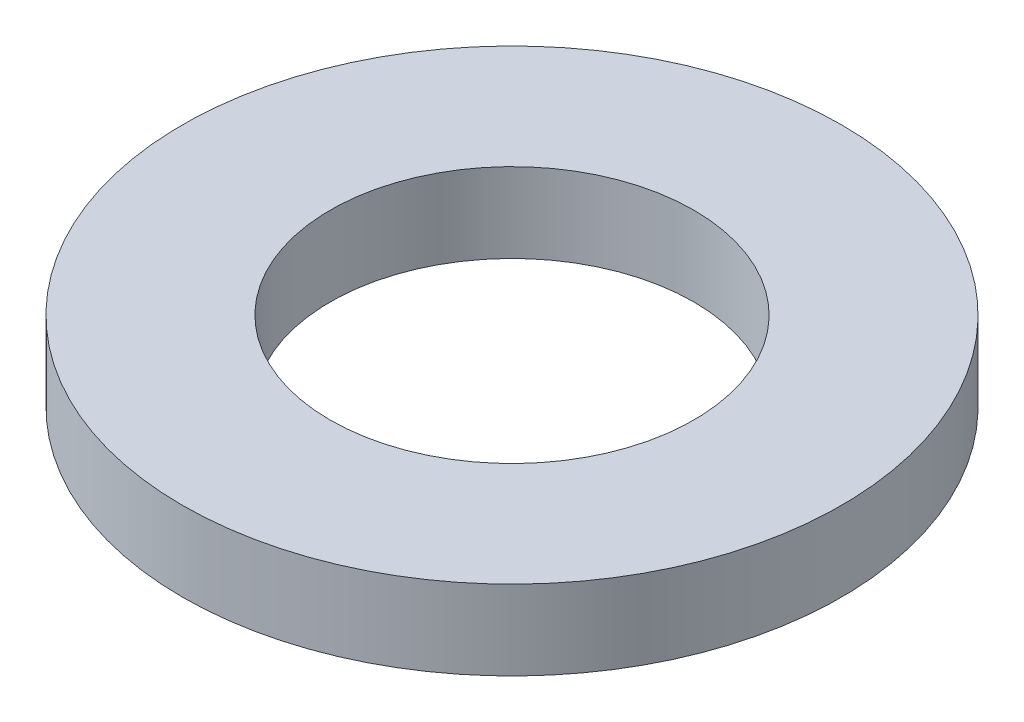
ISO-10303-21;
HEADER;
FILE_DESCRIPTION(('STEP AP214'),'2;1');
FILE_NAME('part.step','',(''),(''),'','','');
FILE_SCHEMA(('AUTOMOTIVE_DESIGN { 1 0 10303 214 1 1 1 1 }'));
ENDSEC;
DATA;
#1=APPLICATION_CONTEXT('core data for automotive mechanical design processes');
#2=APPLICATION_PROTOCOL_DEFINITION('international standard','automotive_design',2000,#1);
#3=PRODUCT_CONTEXT('',#1,'mechanical');
#4=PRODUCT('Part','Part','',(#3));
#5=PRODUCT_RELATED_PRODUCT_CATEGORY('part','',(#4));
#6=PRODUCT_DEFINITION_FORMATION('','',#4);
#7=PRODUCT_DEFINITION_CONTEXT('part definition',#1,'design');
#8=PRODUCT_DEFINITION('design','',#6,#7);
#9=PRODUCT_DEFINITION_SHAPE('','',#8);
#10=(LENGTH_UNIT() NAMED_UNIT(*) SI_UNIT(.MILLI.,.METRE.));
#11=(NAMED_UNIT(*) PLANE_ANGLE_UNIT() SI_UNIT($,.RADIAN.));
#12=(NAMED_UNIT(*) SI_UNIT($,.STERADIAN.) SOLID_ANGLE_UNIT());
#13=UNCERTAINTY_MEASURE_WITH_UNIT(LENGTH_MEASURE(1.E-05),#10,'distance_accuracy_value','');
#14=(GEOMETRIC_REPRESENTATION_CONTEXT(3) GLOBAL_UNCERTAINTY_ASSIGNED_CONTEXT((#13)) GLOBAL_UNIT_ASSIGNED_CONTEXT((#10,
#11,#12)) REPRESENTATION_CONTEXT('',''));
#15=CARTESIAN_POINT('',(0.,0.,0.));
#16=DIRECTION('',(0.,0.,1.));
#17=DIRECTION('',(1.,0.,0.));
#18=AXIS2_PLACEMENT_3D('',#15,#16,#17);
#19=CARTESIAN_POINT('',(0.,0.7,0.));
#20=DIRECTION('',(0.,1.,0.));
#21=DIRECTION('',(0.,0.,1.));
#22=AXIS2_PLACEMENT_3D('',#19,#20,#21);
#23=PLANE('',#22);
#24=CARTESIAN_POINT('',(0.,0.7,0.));
#25=DIRECTION('',(0.,1.,0.));
#26=DIRECTION('',(0.,0.,1.));
#27=AXIS2_PLACEMENT_3D('',#24,#25,#26);
#28=CIRCLE('',#27,2.9);
#29=CARTESIAN_POINT('',(0.,0.7,2.9));
#30=VERTEX_POINT('',#29);
#31=EDGE_CURVE('E10',#30,#30,#28,.T.);
#32=ORIENTED_EDGE('',*,*,#31,.T.);
#33=EDGE_LOOP('',(#32));
#34=FACE_BOUND('',#33,.T.);
#35=CARTESIAN_POINT('',(0.,0.7,0.));
#36=DIRECTION('',(0.,1.,0.));
#37=DIRECTION('',(0.,0.,1.));
#38=AXIS2_PLACEMENT_3D('',#35,#36,#37);
#39=CIRCLE('',#38,1.6);
#40=CARTESIAN_POINT('',(0.,0.7,1.6));
#41=VERTEX_POINT('',#40);
#42=EDGE_CURVE('E50',#41,#41,#39,.T.);
#43=ORIENTED_EDGE('',*,*,#42,.F.);
#44=EDGE_LOOP('',(#43));
#45=FACE_BOUND('',#44,.T.);
#46=ADVANCED_FACE('F37',(#34,#45),#23,.T.);
#47=CARTESIAN_POINT('',(0.,0.,0.));
#48=DIRECTION('',(0.,1.,0.));
#49=DIRECTION('',(0.,0.,1.));
#50=AXIS2_PLACEMENT_3D('',#47,#48,#49);
#51=PLANE('',#50);
#52=CARTESIAN_POINT('',(0.,0.,0.));
#53=DIRECTION('',(0.,1.,0.));
#54=DIRECTION('',(0.,0.,1.));
#55=AXIS2_PLACEMENT_3D('',#52,#53,#54);
#56=CIRCLE('',#55,2.9);
#57=CARTESIAN_POINT('',(0.,0.,2.9));
#58=VERTEX_POINT('',#57);
#59=EDGE_CURVE('E41',#58,#58,#56,.T.);
#60=ORIENTED_EDGE('',*,*,#59,.F.);
#61=EDGE_LOOP('',(#60));
#62=FACE_BOUND('',#61,.T.);
#63=CARTESIAN_POINT('',(0.,0.,0.));
#64=DIRECTION('',(0.,1.,0.));
#65=DIRECTION('',(0.,0.,1.));
#66=AXIS2_PLACEMENT_3D('',#63,#64,#65);
#67=CIRCLE('',#66,1.6);
#68=CARTESIAN_POINT('',(0.,0.,1.6));
#69=VERTEX_POINT('',#68);
#70=EDGE_CURVE('E52',#69,#69,#67,.T.);
#71=ORIENTED_EDGE('',*,*,#70,.T.);
#72=EDGE_LOOP('',(#71));
#73=FACE_BOUND('',#72,.T.);
#74=ADVANCED_FACE('F64',(#62,#73),#51,.F.);
#75=CARTESIAN_POINT('',(0.,0.7,0.));
#76=DIRECTION('',(0.,-1.,0.));
#77=DIRECTION('',(0.,0.,-1.));
#78=AXIS2_PLACEMENT_3D('',#75,#76,#77);
#79=CYLINDRICAL_SURFACE('',#78,2.9);
#80=ORIENTED_EDGE('',*,*,#31,.F.);
#81=EDGE_LOOP('',(#80));
#82=FACE_BOUND('',#81,.T.);
#83=ORIENTED_EDGE('',*,*,#59,.T.);
#84=EDGE_LOOP('',(#83));
#85=FACE_BOUND('',#84,.T.);
#86=ADVANCED_FACE('F39',(#82,#85),#79,.T.);
#87=CARTESIAN_POINT('',(0.,0.7,0.));
#88=DIRECTION('',(0.,-1.,0.));
#89=DIRECTION('',(0.,0.,-1.));
#90=AXIS2_PLACEMENT_3D('',#87,#88,#89);
#91=CYLINDRICAL_SURFACE('',#90,1.6);
#92=ORIENTED_EDGE('',*,*,#42,.T.);
#93=EDGE_LOOP('',(#92));
#94=FACE_BOUND('',#93,.T.);
#95=ORIENTED_EDGE('',*,*,#70,.F.);
#96=EDGE_LOOP('',(#95));
#97=FACE_BOUND('',#96,.T.);
#98=ADVANCED_FACE('F60',(#94,#97),#91,.F.);
#99=CLOSED_SHELL('',(#46,#74,#86,#98));
#100=MANIFOLD_SOLID_BREP('B2',#99);
#101=ADVANCED_BREP_SHAPE_REPRESENTATION('',(#18,#100),#14);
#102=SHAPE_DEFINITION_REPRESENTATION(#9,#101);
ENDSEC;
END-ISO-10303-21;
